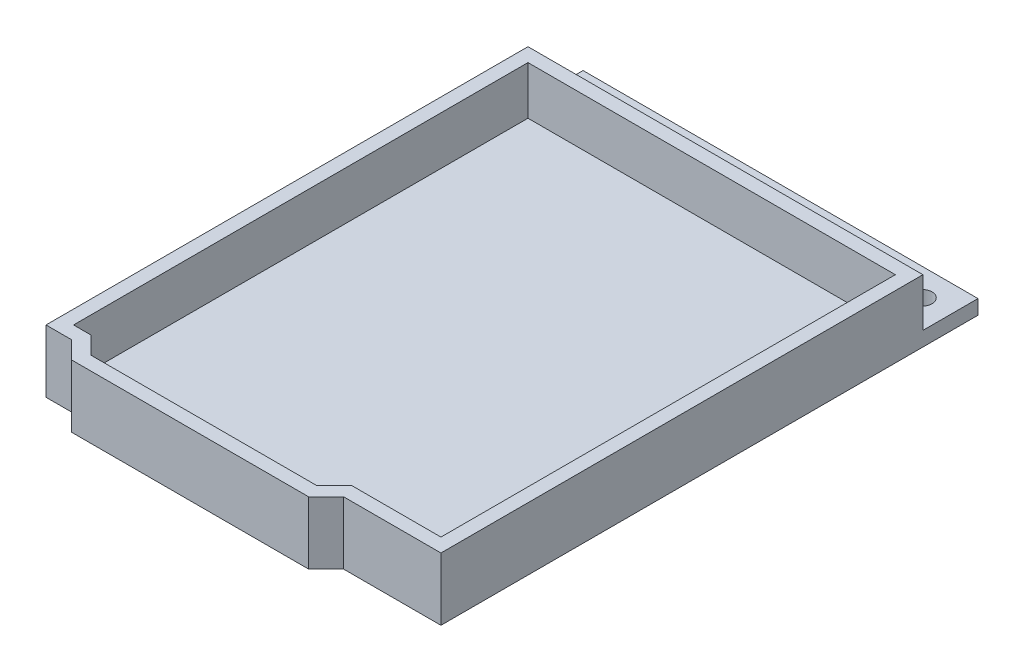
ISO-10303-21;
HEADER;
FILE_DESCRIPTION(('STEP AP214'),'2;1');
FILE_NAME('part.step','',(''),(''),'','','');
FILE_SCHEMA(('AUTOMOTIVE_DESIGN { 1 0 10303 214 1 1 1 1 }'));
ENDSEC;
DATA;
#1=APPLICATION_CONTEXT('core data for automotive mechanical design processes');
#2=APPLICATION_PROTOCOL_DEFINITION('international standard','automotive_design',2000,#1);
#3=PRODUCT_CONTEXT('',#1,'mechanical');
#4=PRODUCT('Part','Part','',(#3));
#5=PRODUCT_RELATED_PRODUCT_CATEGORY('part','',(#4));
#6=PRODUCT_DEFINITION_FORMATION('','',#4);
#7=PRODUCT_DEFINITION_CONTEXT('part definition',#1,'design');
#8=PRODUCT_DEFINITION('design','',#6,#7);
#9=PRODUCT_DEFINITION_SHAPE('','',#8);
#10=(LENGTH_UNIT() NAMED_UNIT(*) SI_UNIT(.MILLI.,.METRE.));
#11=(NAMED_UNIT(*) PLANE_ANGLE_UNIT() SI_UNIT($,.RADIAN.));
#12=(NAMED_UNIT(*) SI_UNIT($,.STERADIAN.) SOLID_ANGLE_UNIT());
#13=UNCERTAINTY_MEASURE_WITH_UNIT(LENGTH_MEASURE(1.E-05),#10,'distance_accuracy_value','');
#14=(GEOMETRIC_REPRESENTATION_CONTEXT(3) GLOBAL_UNCERTAINTY_ASSIGNED_CONTEXT((#13)) GLOBAL_UNIT_ASSIGNED_CONTEXT((#10,
#11,#12)) REPRESENTATION_CONTEXT('',''));
#15=CARTESIAN_POINT('',(0.,0.,0.));
#16=DIRECTION('',(0.,0.,1.));
#17=DIRECTION('',(1.,0.,0.));
#18=AXIS2_PLACEMENT_3D('',#15,#16,#17);
#19=CARTESIAN_POINT('',(28.68,2.1,78.));
#20=DIRECTION('',(0.,0.,-1.));
#21=DIRECTION('',(-1.,0.,0.));
#22=AXIS2_PLACEMENT_3D('',#19,#20,#21);
#23=PLANE('',#22);
#24=DIRECTION('',(1.,0.,0.));
#25=VECTOR('',#24,1.);
#26=CARTESIAN_POINT('',(28.68,0.,78.));
#27=LINE('',#26,#25);
#28=CARTESIAN_POINT('',(-28.68,0.,78.));
#29=VERTEX_POINT('',#28);
#30=CARTESIAN_POINT('',(-24.9684271247462,0.,78.));
#31=VERTEX_POINT('',#30);
#32=EDGE_CURVE('E299',#29,#31,#27,.T.);
#33=ORIENTED_EDGE('',*,*,#32,.T.);
#34=DIRECTION('',(0.,1.,0.));
#35=VECTOR('',#34,1.);
#36=CARTESIAN_POINT('',(-24.9684271247462,-41.4677023071934,78.));
#37=LINE('',#36,#35);
#38=CARTESIAN_POINT('',(-24.9684271247462,9.1,78.));
#39=VERTEX_POINT('',#38);
#40=EDGE_CURVE('E188',#31,#39,#37,.T.);
#41=ORIENTED_EDGE('',*,*,#40,.T.);
#42=DIRECTION('',(1.,0.,0.));
#43=VECTOR('',#42,1.);
#44=CARTESIAN_POINT('',(-28.68,9.1,78.));
#45=LINE('',#44,#43);
#46=CARTESIAN_POINT('',(-28.68,9.1,78.));
#47=VERTEX_POINT('',#46);
#48=EDGE_CURVE('E274',#47,#39,#45,.T.);
#49=ORIENTED_EDGE('',*,*,#48,.F.);
#50=DIRECTION('',(0.,-1.,0.));
#51=VECTOR('',#50,1.);
#52=CARTESIAN_POINT('',(-28.68,2.1,78.));
#53=LINE('',#52,#51);
#54=EDGE_CURVE('E43',#47,#29,#53,.T.);
#55=ORIENTED_EDGE('',*,*,#54,.T.);
#56=EDGE_LOOP('',(#33,#41,#49,#55));
#57=FACE_BOUND('',#56,.T.);
#58=ADVANCED_FACE('F35',(#57),#23,.F.);
#59=CARTESIAN_POINT('',(0.,2.1,0.));
#60=DIRECTION('',(0.,-1.,0.));
#61=DIRECTION('',(0.,0.,-1.));
#62=AXIS2_PLACEMENT_3D('',#59,#60,#61);
#63=PLANE('',#62);
#64=CARTESIAN_POINT('',(24.5,2.1,4.00000000000001));
#65=DIRECTION('',(0.,1.,0.));
#66=DIRECTION('',(0.,0.,1.));
#67=AXIS2_PLACEMENT_3D('',#64,#65,#66);
#68=CIRCLE('',#67,1.5);
#69=CARTESIAN_POINT('',(24.5,2.1,5.50000000000001));
#70=VERTEX_POINT('',#69);
#71=EDGE_CURVE('E225',#70,#70,#68,.T.);
#72=ORIENTED_EDGE('',*,*,#71,.F.);
#73=EDGE_LOOP('',(#72));
#74=FACE_BOUND('',#73,.T.);
#75=CARTESIAN_POINT('',(-24.5,2.1,4.00000000000001));
#76=DIRECTION('',(0.,1.,0.));
#77=DIRECTION('',(0.,0.,1.));
#78=AXIS2_PLACEMENT_3D('',#75,#76,#77);
#79=CIRCLE('',#78,1.5);
#80=CARTESIAN_POINT('',(-24.5,2.1,5.50000000000001));
#81=VERTEX_POINT('',#80);
#82=EDGE_CURVE('E224',#81,#81,#79,.T.);
#83=ORIENTED_EDGE('',*,*,#82,.F.);
#84=EDGE_LOOP('',(#83));
#85=FACE_BOUND('',#84,.T.);
#86=DIRECTION('',(-1.,0.,0.));
#87=VECTOR('',#86,1.);
#88=CARTESIAN_POINT('',(28.68,2.1,8.));
#89=LINE('',#88,#87);
#90=CARTESIAN_POINT('',(28.68,2.1,8.));
#91=VERTEX_POINT('',#90);
#92=CARTESIAN_POINT('',(-28.68,2.1,8.));
#93=VERTEX_POINT('',#92);
#94=EDGE_CURVE('E260',#91,#93,#89,.T.);
#95=ORIENTED_EDGE('',*,*,#94,.F.);
#96=DIRECTION('',(0.,0.,-1.));
#97=VECTOR('',#96,1.);
#98=CARTESIAN_POINT('',(28.68,2.1,8.));
#99=LINE('',#98,#97);
#100=CARTESIAN_POINT('',(28.68,2.1,0.));
#101=VERTEX_POINT('',#100);
#102=EDGE_CURVE('E291',#91,#101,#99,.T.);
#103=ORIENTED_EDGE('',*,*,#102,.T.);
#104=DIRECTION('',(-1.,0.,0.));
#105=VECTOR('',#104,1.);
#106=CARTESIAN_POINT('',(28.68,2.1,0.));
#107=LINE('',#106,#105);
#108=CARTESIAN_POINT('',(-28.68,2.1,0.));
#109=VERTEX_POINT('',#108);
#110=EDGE_CURVE('E285',#101,#109,#107,.T.);
#111=ORIENTED_EDGE('',*,*,#110,.T.);
#112=DIRECTION('',(0.,0.,1.));
#113=VECTOR('',#112,1.);
#114=CARTESIAN_POINT('',(-28.68,2.1,78.));
#115=LINE('',#114,#113);
#116=EDGE_CURVE('E288',#109,#93,#115,.T.);
#117=ORIENTED_EDGE('',*,*,#116,.T.);
#118=EDGE_LOOP('',(#95,#103,#111,#117));
#119=FACE_BOUND('',#118,.T.);
#120=ADVANCED_FACE('F334',(#74,#85,#119),#63,.F.);
#121=CARTESIAN_POINT('',(28.68,2.1,0.));
#122=DIRECTION('',(0.,0.,1.));
#123=DIRECTION('',(1.,0.,0.));
#124=AXIS2_PLACEMENT_3D('',#121,#122,#123);
#125=PLANE('',#124);
#126=DIRECTION('',(-1.,0.,0.));
#127=VECTOR('',#126,1.);
#128=CARTESIAN_POINT('',(28.68,0.,0.));
#129=LINE('',#128,#127);
#130=CARTESIAN_POINT('',(28.68,0.,0.));
#131=VERTEX_POINT('',#130);
#132=CARTESIAN_POINT('',(-28.68,0.,0.));
#133=VERTEX_POINT('',#132);
#134=EDGE_CURVE('E284',#131,#133,#129,.T.);
#135=ORIENTED_EDGE('',*,*,#134,.T.);
#136=DIRECTION('',(0.,-1.,0.));
#137=VECTOR('',#136,1.);
#138=CARTESIAN_POINT('',(-28.68,2.1,0.));
#139=LINE('',#138,#137);
#140=EDGE_CURVE('E11',#109,#133,#139,.T.);
#141=ORIENTED_EDGE('',*,*,#140,.F.);
#142=ORIENTED_EDGE('',*,*,#110,.F.);
#143=DIRECTION('',(0.,-1.,0.));
#144=VECTOR('',#143,1.);
#145=CARTESIAN_POINT('',(28.68,2.1,0.));
#146=LINE('',#145,#144);
#147=EDGE_CURVE('E293',#101,#131,#146,.T.);
#148=ORIENTED_EDGE('',*,*,#147,.T.);
#149=EDGE_LOOP('',(#135,#141,#142,#148));
#150=FACE_BOUND('',#149,.T.);
#151=ADVANCED_FACE('F37',(#150),#125,.F.);
#152=CARTESIAN_POINT('',(-28.68,2.1,78.));
#153=DIRECTION('',(1.,0.,0.));
#154=DIRECTION('',(0.,0.,-1.));
#155=AXIS2_PLACEMENT_3D('',#152,#153,#154);
#156=PLANE('',#155);
#157=DIRECTION('',(0.,0.,1.));
#158=VECTOR('',#157,1.);
#159=CARTESIAN_POINT('',(-28.68,0.,78.));
#160=LINE('',#159,#158);
#161=EDGE_CURVE('E296',#133,#29,#160,.T.);
#162=ORIENTED_EDGE('',*,*,#161,.T.);
#163=ORIENTED_EDGE('',*,*,#54,.F.);
#164=DIRECTION('',(0.,0.,1.));
#165=VECTOR('',#164,1.);
#166=CARTESIAN_POINT('',(-28.68,9.1,8.));
#167=LINE('',#166,#165);
#168=CARTESIAN_POINT('',(-28.68,9.1,8.));
#169=VERTEX_POINT('',#168);
#170=EDGE_CURVE('E270',#169,#47,#167,.T.);
#171=ORIENTED_EDGE('',*,*,#170,.F.);
#172=DIRECTION('',(0.,-1.,0.));
#173=VECTOR('',#172,1.);
#174=CARTESIAN_POINT('',(-28.68,9.1,8.));
#175=LINE('',#174,#173);
#176=EDGE_CURVE('E276',#169,#93,#175,.T.);
#177=ORIENTED_EDGE('',*,*,#176,.T.);
#178=ORIENTED_EDGE('',*,*,#116,.F.);
#179=ORIENTED_EDGE('',*,*,#140,.T.);
#180=EDGE_LOOP('',(#162,#163,#171,#177,#178,#179));
#181=FACE_BOUND('',#180,.T.);
#182=ADVANCED_FACE('F328',(#181),#156,.F.);
#183=CARTESIAN_POINT('',(14.5384271247462,9.1,78.));
#184=VERTEX_POINT('',#183);
#185=CARTESIAN_POINT('',(28.68,9.1,78.));
#186=VERTEX_POINT('',#185);
#187=EDGE_CURVE('E273',#184,#186,#45,.T.);
#188=ORIENTED_EDGE('',*,*,#187,.F.);
#189=DIRECTION('',(0.,1.,0.));
#190=VECTOR('',#189,1.);
#191=CARTESIAN_POINT('',(14.5384271247462,-41.4677023071934,78.));
#192=LINE('',#191,#190);
#193=CARTESIAN_POINT('',(14.5384271247462,0.,78.));
#194=VERTEX_POINT('',#193);
#195=EDGE_CURVE('E205',#194,#184,#192,.T.);
#196=ORIENTED_EDGE('',*,*,#195,.F.);
#197=CARTESIAN_POINT('',(28.68,0.,78.));
#198=VERTEX_POINT('',#197);
#199=EDGE_CURVE('E298',#194,#198,#27,.T.);
#200=ORIENTED_EDGE('',*,*,#199,.T.);
#201=DIRECTION('',(0.,-1.,0.));
#202=VECTOR('',#201,1.);
#203=CARTESIAN_POINT('',(28.68,2.1,78.));
#204=LINE('',#203,#202);
#205=EDGE_CURVE('E304',#186,#198,#204,.T.);
#206=ORIENTED_EDGE('',*,*,#205,.F.);
#207=EDGE_LOOP('',(#188,#196,#200,#206));
#208=FACE_BOUND('',#207,.T.);
#209=ADVANCED_FACE('F346',(#208),#23,.F.);
#210=CARTESIAN_POINT('',(28.68,2.1,0.));
#211=DIRECTION('',(-1.,0.,0.));
#212=DIRECTION('',(0.,0.,1.));
#213=AXIS2_PLACEMENT_3D('',#210,#211,#212);
#214=PLANE('',#213);
#215=DIRECTION('',(0.,0.,-1.));
#216=VECTOR('',#215,1.);
#217=CARTESIAN_POINT('',(28.68,0.,0.));
#218=LINE('',#217,#216);
#219=EDGE_CURVE('E289',#198,#131,#218,.T.);
#220=ORIENTED_EDGE('',*,*,#219,.T.);
#221=ORIENTED_EDGE('',*,*,#147,.F.);
#222=ORIENTED_EDGE('',*,*,#102,.F.);
#223=DIRECTION('',(0.,-1.,0.));
#224=VECTOR('',#223,1.);
#225=CARTESIAN_POINT('',(28.68,9.1,8.));
#226=LINE('',#225,#224);
#227=CARTESIAN_POINT('',(28.68,9.1,8.));
#228=VERTEX_POINT('',#227);
#229=EDGE_CURVE('E281',#228,#91,#226,.T.);
#230=ORIENTED_EDGE('',*,*,#229,.F.);
#231=DIRECTION('',(0.,0.,-1.));
#232=VECTOR('',#231,1.);
#233=CARTESIAN_POINT('',(28.68,9.1,78.));
#234=LINE('',#233,#232);
#235=EDGE_CURVE('E265',#186,#228,#234,.T.);
#236=ORIENTED_EDGE('',*,*,#235,.F.);
#237=ORIENTED_EDGE('',*,*,#205,.T.);
#238=EDGE_LOOP('',(#220,#221,#222,#230,#236,#237));
#239=FACE_BOUND('',#238,.T.);
#240=ADVANCED_FACE('F337',(#239),#214,.F.);
#241=CARTESIAN_POINT('',(0.,0.,0.));
#242=DIRECTION('',(0.,-1.,0.));
#243=DIRECTION('',(0.,0.,-1.));
#244=AXIS2_PLACEMENT_3D('',#241,#242,#243);
#245=PLANE('',#244);
#246=ORIENTED_EDGE('',*,*,#199,.F.);
#247=DIRECTION('',(0.707106781186541,0.,-0.707106781186554));
#248=VECTOR('',#247,1.);
#249=CARTESIAN_POINT('',(14.5384271247462,0.,78.));
#250=LINE('',#249,#248);
#251=CARTESIAN_POINT('',(11.9984271247463,0.,80.54));
#252=VERTEX_POINT('',#251);
#253=EDGE_CURVE('E203',#252,#194,#250,.T.);
#254=ORIENTED_EDGE('',*,*,#253,.F.);
#255=DIRECTION('',(1.,0.,0.));
#256=VECTOR('',#255,1.);
#257=CARTESIAN_POINT('',(-22.4284271247462,0.,80.54));
#258=LINE('',#257,#256);
#259=CARTESIAN_POINT('',(-22.4284271247462,0.,80.54));
#260=VERTEX_POINT('',#259);
#261=EDGE_CURVE('E207',#260,#252,#258,.T.);
#262=ORIENTED_EDGE('',*,*,#261,.F.);
#263=DIRECTION('',(0.707106781186548,0.,0.707106781186548));
#264=VECTOR('',#263,1.);
#265=CARTESIAN_POINT('',(-24.9684271247462,0.,78.));
#266=LINE('',#265,#264);
#267=EDGE_CURVE('E211',#31,#260,#266,.T.);
#268=ORIENTED_EDGE('',*,*,#267,.F.);
#269=ORIENTED_EDGE('',*,*,#32,.F.);
#270=ORIENTED_EDGE('',*,*,#161,.F.);
#271=ORIENTED_EDGE('',*,*,#134,.F.);
#272=ORIENTED_EDGE('',*,*,#219,.F.);
#273=EDGE_LOOP('',(#246,#254,#262,#268,#269,#270,#271,#272));
#274=FACE_BOUND('',#273,.T.);
#275=CARTESIAN_POINT('',(24.5,0.,4.00000000000001));
#276=DIRECTION('',(0.,-1.,0.));
#277=DIRECTION('',(0.,0.,-1.));
#278=AXIS2_PLACEMENT_3D('',#275,#276,#277);
#279=CIRCLE('',#278,1.5);
#280=CARTESIAN_POINT('',(24.5,0.,2.5));
#281=VERTEX_POINT('',#280);
#282=EDGE_CURVE('E228',#281,#281,#279,.F.);
#283=ORIENTED_EDGE('',*,*,#282,.T.);
#284=EDGE_LOOP('',(#283));
#285=FACE_BOUND('',#284,.T.);
#286=CARTESIAN_POINT('',(-24.5,0.,4.00000000000001));
#287=DIRECTION('',(0.,-1.,0.));
#288=DIRECTION('',(0.,0.,-1.));
#289=AXIS2_PLACEMENT_3D('',#286,#287,#288);
#290=CIRCLE('',#289,1.5);
#291=CARTESIAN_POINT('',(-24.5,0.,2.50000000000001));
#292=VERTEX_POINT('',#291);
#293=EDGE_CURVE('E229',#292,#292,#290,.F.);
#294=ORIENTED_EDGE('',*,*,#293,.T.);
#295=EDGE_LOOP('',(#294));
#296=FACE_BOUND('',#295,.T.);
#297=ADVANCED_FACE('F315',(#274,#285,#296),#245,.T.);
#298=CARTESIAN_POINT('',(28.68,9.1,8.));
#299=DIRECTION('',(0.,0.,1.));
#300=DIRECTION('',(1.,0.,0.));
#301=AXIS2_PLACEMENT_3D('',#298,#299,#300);
#302=PLANE('',#301);
#303=ORIENTED_EDGE('',*,*,#94,.T.);
#304=ORIENTED_EDGE('',*,*,#176,.F.);
#305=DIRECTION('',(-1.,0.,0.));
#306=VECTOR('',#305,1.);
#307=CARTESIAN_POINT('',(28.68,9.1,8.));
#308=LINE('',#307,#306);
#309=EDGE_CURVE('E268',#228,#169,#308,.T.);
#310=ORIENTED_EDGE('',*,*,#309,.F.);
#311=ORIENTED_EDGE('',*,*,#229,.T.);
#312=EDGE_LOOP('',(#303,#304,#310,#311));
#313=FACE_BOUND('',#312,.T.);
#314=ADVANCED_FACE('F330',(#313),#302,.F.);
#315=CARTESIAN_POINT('',(0.,9.1,0.));
#316=DIRECTION('',(0.,1.,0.));
#317=DIRECTION('',(0.,0.,1.));
#318=AXIS2_PLACEMENT_3D('',#315,#316,#317);
#319=PLANE('',#318);
#320=DIRECTION('',(0.707106781186541,0.,-0.707106781186554));
#321=VECTOR('',#320,1.);
#322=CARTESIAN_POINT('',(14.5384271247462,9.1,78.));
#323=LINE('',#322,#321);
#324=CARTESIAN_POINT('',(11.9984271247463,9.1,80.54));
#325=VERTEX_POINT('',#324);
#326=EDGE_CURVE('E195',#325,#184,#323,.T.);
#327=ORIENTED_EDGE('',*,*,#326,.T.);
#328=ORIENTED_EDGE('',*,*,#187,.T.);
#329=ORIENTED_EDGE('',*,*,#235,.T.);
#330=ORIENTED_EDGE('',*,*,#309,.T.);
#331=ORIENTED_EDGE('',*,*,#170,.T.);
#332=ORIENTED_EDGE('',*,*,#48,.T.);
#333=DIRECTION('',(0.707106781186548,0.,0.707106781186548));
#334=VECTOR('',#333,1.);
#335=CARTESIAN_POINT('',(-24.9684271247462,9.1,78.));
#336=LINE('',#335,#334);
#337=CARTESIAN_POINT('',(-22.4284271247462,9.1,80.54));
#338=VERTEX_POINT('',#337);
#339=EDGE_CURVE('E182',#39,#338,#336,.T.);
#340=ORIENTED_EDGE('',*,*,#339,.T.);
#341=DIRECTION('',(1.,0.,0.));
#342=VECTOR('',#341,1.);
#343=CARTESIAN_POINT('',(-22.4284271247462,9.1,80.54));
#344=LINE('',#343,#342);
#345=EDGE_CURVE('E198',#338,#325,#344,.T.);
#346=ORIENTED_EDGE('',*,*,#345,.T.);
#347=EDGE_LOOP('',(#327,#328,#329,#330,#331,#332,#340,#346));
#348=FACE_BOUND('',#347,.T.);
#349=DIRECTION('',(0.,0.,-1.));
#350=VECTOR('',#349,1.);
#351=CARTESIAN_POINT('',(26.68,9.1,10.));
#352=LINE('',#351,#350);
#353=CARTESIAN_POINT('',(26.68,9.1,76.));
#354=VERTEX_POINT('',#353);
#355=CARTESIAN_POINT('',(26.68,9.1,10.));
#356=VERTEX_POINT('',#355);
#357=EDGE_CURVE('E253',#354,#356,#352,.T.);
#358=ORIENTED_EDGE('',*,*,#357,.F.);
#359=DIRECTION('',(1.,0.,0.));
#360=VECTOR('',#359,1.);
#361=CARTESIAN_POINT('',(-26.68,9.1,76.));
#362=LINE('',#361,#360);
#363=CARTESIAN_POINT('',(13.71,9.1,76.));
#364=VERTEX_POINT('',#363);
#365=EDGE_CURVE('E251',#364,#354,#362,.T.);
#366=ORIENTED_EDGE('',*,*,#365,.F.);
#367=DIRECTION('',(-0.707106781186548,0.,0.707106781186548));
#368=VECTOR('',#367,1.);
#369=CARTESIAN_POINT('',(13.71,9.1,76.));
#370=LINE('',#369,#368);
#371=CARTESIAN_POINT('',(11.17,9.1,78.54));
#372=VERTEX_POINT('',#371);
#373=EDGE_CURVE('E192',#364,#372,#370,.T.);
#374=ORIENTED_EDGE('',*,*,#373,.T.);
#375=DIRECTION('',(-1.,0.,0.));
#376=VECTOR('',#375,1.);
#377=CARTESIAN_POINT('',(-21.6,9.1,78.54));
#378=LINE('',#377,#376);
#379=CARTESIAN_POINT('',(-21.6,9.1,78.54));
#380=VERTEX_POINT('',#379);
#381=EDGE_CURVE('E190',#372,#380,#378,.T.);
#382=ORIENTED_EDGE('',*,*,#381,.T.);
#383=DIRECTION('',(-0.707106781186548,0.,-0.707106781186548));
#384=VECTOR('',#383,1.);
#385=CARTESIAN_POINT('',(-21.6,9.1,78.54));
#386=LINE('',#385,#384);
#387=CARTESIAN_POINT('',(-24.14,9.1,76.));
#388=VERTEX_POINT('',#387);
#389=EDGE_CURVE('E165',#380,#388,#386,.T.);
#390=ORIENTED_EDGE('',*,*,#389,.T.);
#391=DIRECTION('',(-1.,0.,0.));
#392=VECTOR('',#391,1.);
#393=CARTESIAN_POINT('',(-26.68,9.1,76.));
#394=LINE('',#393,#392);
#395=CARTESIAN_POINT('',(-26.68,9.1,76.));
#396=VERTEX_POINT('',#395);
#397=EDGE_CURVE('E185',#388,#396,#394,.T.);
#398=ORIENTED_EDGE('',*,*,#397,.T.);
#399=DIRECTION('',(0.,0.,1.));
#400=VECTOR('',#399,1.);
#401=CARTESIAN_POINT('',(-26.68,9.1,10.));
#402=LINE('',#401,#400);
#403=CARTESIAN_POINT('',(-26.68,9.1,10.));
#404=VERTEX_POINT('',#403);
#405=EDGE_CURVE('E232',#404,#396,#402,.T.);
#406=ORIENTED_EDGE('',*,*,#405,.F.);
#407=DIRECTION('',(-1.,0.,0.));
#408=VECTOR('',#407,1.);
#409=CARTESIAN_POINT('',(-26.68,9.1,10.));
#410=LINE('',#409,#408);
#411=EDGE_CURVE('E240',#356,#404,#410,.T.);
#412=ORIENTED_EDGE('',*,*,#411,.F.);
#413=EDGE_LOOP('',(#358,#366,#374,#382,#390,#398,#406,#412));
#414=FACE_BOUND('',#413,.T.);
#415=ADVANCED_FACE('F325',(#348,#414),#319,.T.);
#416=CARTESIAN_POINT('',(-26.68,2.1,10.));
#417=DIRECTION('',(-1.,0.,0.));
#418=DIRECTION('',(0.,0.,1.));
#419=AXIS2_PLACEMENT_3D('',#416,#417,#418);
#420=PLANE('',#419);
#421=ORIENTED_EDGE('',*,*,#405,.T.);
#422=DIRECTION('',(0.,1.,0.));
#423=VECTOR('',#422,1.);
#424=CARTESIAN_POINT('',(-26.68,-41.4677023071934,76.));
#425=LINE('',#424,#423);
#426=CARTESIAN_POINT('',(-26.68,2.09999999999997,76.));
#427=VERTEX_POINT('',#426);
#428=EDGE_CURVE('E214',#427,#396,#425,.T.);
#429=ORIENTED_EDGE('',*,*,#428,.F.);
#430=DIRECTION('',(0.,0.,1.));
#431=VECTOR('',#430,1.);
#432=CARTESIAN_POINT('',(-26.68,2.1,10.));
#433=LINE('',#432,#431);
#434=CARTESIAN_POINT('',(-26.68,2.1,10.));
#435=VERTEX_POINT('',#434);
#436=EDGE_CURVE('E237',#435,#427,#433,.T.);
#437=ORIENTED_EDGE('',*,*,#436,.F.);
#438=DIRECTION('',(0.,1.,0.));
#439=VECTOR('',#438,1.);
#440=CARTESIAN_POINT('',(-26.68,2.1,10.));
#441=LINE('',#440,#439);
#442=EDGE_CURVE('E258',#435,#404,#441,.T.);
#443=ORIENTED_EDGE('',*,*,#442,.T.);
#444=EDGE_LOOP('',(#421,#429,#437,#443));
#445=FACE_BOUND('',#444,.T.);
#446=ADVANCED_FACE('F438',(#445),#420,.F.);
#447=CARTESIAN_POINT('',(-26.68,2.1,10.));
#448=DIRECTION('',(0.,0.,-1.));
#449=DIRECTION('',(-1.,0.,0.));
#450=AXIS2_PLACEMENT_3D('',#447,#448,#449);
#451=PLANE('',#450);
#452=ORIENTED_EDGE('',*,*,#411,.T.);
#453=ORIENTED_EDGE('',*,*,#442,.F.);
#454=DIRECTION('',(-1.,0.,0.));
#455=VECTOR('',#454,1.);
#456=CARTESIAN_POINT('',(-26.68,2.1,10.));
#457=LINE('',#456,#455);
#458=CARTESIAN_POINT('',(26.68,2.1,10.));
#459=VERTEX_POINT('',#458);
#460=EDGE_CURVE('E245',#459,#435,#457,.T.);
#461=ORIENTED_EDGE('',*,*,#460,.F.);
#462=DIRECTION('',(0.,1.,0.));
#463=VECTOR('',#462,1.);
#464=CARTESIAN_POINT('',(26.68,2.1,10.));
#465=LINE('',#464,#463);
#466=EDGE_CURVE('E261',#459,#356,#465,.T.);
#467=ORIENTED_EDGE('',*,*,#466,.T.);
#468=EDGE_LOOP('',(#452,#453,#461,#467));
#469=FACE_BOUND('',#468,.T.);
#470=ADVANCED_FACE('F449',(#469),#451,.F.);
#471=CARTESIAN_POINT('',(26.68,2.1,10.));
#472=DIRECTION('',(1.,0.,0.));
#473=DIRECTION('',(0.,0.,-1.));
#474=AXIS2_PLACEMENT_3D('',#471,#472,#473);
#475=PLANE('',#474);
#476=ORIENTED_EDGE('',*,*,#357,.T.);
#477=ORIENTED_EDGE('',*,*,#466,.F.);
#478=DIRECTION('',(0.,0.,-1.));
#479=VECTOR('',#478,1.);
#480=CARTESIAN_POINT('',(26.68,2.1,10.));
#481=LINE('',#480,#479);
#482=CARTESIAN_POINT('',(26.68,2.1,76.));
#483=VERTEX_POINT('',#482);
#484=EDGE_CURVE('E242',#483,#459,#481,.T.);
#485=ORIENTED_EDGE('',*,*,#484,.F.);
#486=DIRECTION('',(0.,1.,0.));
#487=VECTOR('',#486,1.);
#488=CARTESIAN_POINT('',(26.68,2.1,76.));
#489=LINE('',#488,#487);
#490=EDGE_CURVE('E248',#483,#354,#489,.T.);
#491=ORIENTED_EDGE('',*,*,#490,.T.);
#492=EDGE_LOOP('',(#476,#477,#485,#491));
#493=FACE_BOUND('',#492,.T.);
#494=ADVANCED_FACE('F394',(#493),#475,.F.);
#495=CARTESIAN_POINT('',(-26.68,2.1,76.));
#496=DIRECTION('',(0.,0.,1.));
#497=DIRECTION('',(1.,0.,0.));
#498=AXIS2_PLACEMENT_3D('',#495,#496,#497);
#499=PLANE('',#498);
#500=ORIENTED_EDGE('',*,*,#490,.F.);
#501=DIRECTION('',(1.,0.,0.));
#502=VECTOR('',#501,1.);
#503=CARTESIAN_POINT('',(-26.68,2.1,76.));
#504=LINE('',#503,#502);
#505=CARTESIAN_POINT('',(13.71,2.1,76.));
#506=VERTEX_POINT('',#505);
#507=EDGE_CURVE('E239',#506,#483,#504,.T.);
#508=ORIENTED_EDGE('',*,*,#507,.F.);
#509=DIRECTION('',(0.,1.,0.));
#510=VECTOR('',#509,1.);
#511=CARTESIAN_POINT('',(13.71,-40.439486890909,76.));
#512=LINE('',#511,#510);
#513=EDGE_CURVE('E55',#506,#364,#512,.T.);
#514=ORIENTED_EDGE('',*,*,#513,.T.);
#515=ORIENTED_EDGE('',*,*,#365,.T.);
#516=EDGE_LOOP('',(#500,#508,#514,#515));
#517=FACE_BOUND('',#516,.T.);
#518=ADVANCED_FACE('F484',(#517),#499,.F.);
#519=CARTESIAN_POINT('',(0.,2.1,0.));
#520=DIRECTION('',(0.,1.,0.));
#521=DIRECTION('',(0.,0.,1.));
#522=AXIS2_PLACEMENT_3D('',#519,#520,#521);
#523=PLANE('',#522);
#524=ORIENTED_EDGE('',*,*,#436,.T.);
#525=CARTESIAN_POINT('',(-24.14,2.09999999999997,76.));
#526=VERTEX_POINT('',#525);
#527=EDGE_CURVE('E180',#427,#526,#504,.T.);
#528=ORIENTED_EDGE('',*,*,#527,.T.);
#529=DIRECTION('',(-0.707106781186548,0.,-0.707106781186548));
#530=VECTOR('',#529,1.);
#531=CARTESIAN_POINT('',(-24.14,2.1,76.));
#532=LINE('',#531,#530);
#533=CARTESIAN_POINT('',(-21.6,2.10000000000001,78.54));
#534=VERTEX_POINT('',#533);
#535=EDGE_CURVE('E162',#534,#526,#532,.T.);
#536=ORIENTED_EDGE('',*,*,#535,.F.);
#537=DIRECTION('',(-1.,0.,0.));
#538=VECTOR('',#537,1.);
#539=CARTESIAN_POINT('',(-21.6,2.1,78.54));
#540=LINE('',#539,#538);
#541=CARTESIAN_POINT('',(11.17,2.1,78.54));
#542=VERTEX_POINT('',#541);
#543=EDGE_CURVE('E173',#542,#534,#540,.T.);
#544=ORIENTED_EDGE('',*,*,#543,.F.);
#545=DIRECTION('',(-0.707106781186548,0.,0.707106781186548));
#546=VECTOR('',#545,1.);
#547=CARTESIAN_POINT('',(11.17,2.1,78.54));
#548=LINE('',#547,#546);
#549=EDGE_CURVE('E50',#506,#542,#548,.T.);
#550=ORIENTED_EDGE('',*,*,#549,.F.);
#551=ORIENTED_EDGE('',*,*,#507,.T.);
#552=ORIENTED_EDGE('',*,*,#484,.T.);
#553=ORIENTED_EDGE('',*,*,#460,.T.);
#554=EDGE_LOOP('',(#524,#528,#536,#544,#550,#551,#552,#553));
#555=FACE_BOUND('',#554,.T.);
#556=ADVANCED_FACE('F179',(#555),#523,.T.);
#557=CARTESIAN_POINT('',(-24.5,-4.24264068711929,4.00000000000001));
#558=DIRECTION('',(0.,1.,0.));
#559=DIRECTION('',(0.,0.,1.));
#560=AXIS2_PLACEMENT_3D('',#557,#558,#559);
#561=CYLINDRICAL_SURFACE('',#560,1.5);
#562=ORIENTED_EDGE('',*,*,#82,.T.);
#563=EDGE_LOOP('',(#562));
#564=FACE_BOUND('',#563,.T.);
#565=ORIENTED_EDGE('',*,*,#293,.F.);
#566=EDGE_LOOP('',(#565));
#567=FACE_BOUND('',#566,.T.);
#568=ADVANCED_FACE('F399',(#564,#567),#561,.F.);
#569=CARTESIAN_POINT('',(24.5,-4.24264068711929,4.00000000000001));
#570=DIRECTION('',(0.,1.,0.));
#571=DIRECTION('',(0.,0.,1.));
#572=AXIS2_PLACEMENT_3D('',#569,#570,#571);
#573=CYLINDRICAL_SURFACE('',#572,1.5);
#574=ORIENTED_EDGE('',*,*,#71,.T.);
#575=EDGE_LOOP('',(#574));
#576=FACE_BOUND('',#575,.T.);
#577=ORIENTED_EDGE('',*,*,#282,.F.);
#578=EDGE_LOOP('',(#577));
#579=FACE_BOUND('',#578,.T.);
#580=ADVANCED_FACE('F362',(#576,#579),#573,.F.);
#581=CARTESIAN_POINT('',(-24.9684271247462,-41.4677023071934,78.));
#582=DIRECTION('',(-0.707106781186547,0.,0.707106781186547));
#583=DIRECTION('',(0.707106781186548,0.,0.707106781186548));
#584=AXIS2_PLACEMENT_3D('',#581,#582,#583);
#585=PLANE('',#584);
#586=ORIENTED_EDGE('',*,*,#40,.F.);
#587=ORIENTED_EDGE('',*,*,#267,.T.);
#588=DIRECTION('',(0.,1.,0.));
#589=VECTOR('',#588,1.);
#590=CARTESIAN_POINT('',(-22.4284271247462,-41.4677023071934,80.54));
#591=LINE('',#590,#589);
#592=EDGE_CURVE('E210',#260,#338,#591,.T.);
#593=ORIENTED_EDGE('',*,*,#592,.T.);
#594=ORIENTED_EDGE('',*,*,#339,.F.);
#595=EDGE_LOOP('',(#586,#587,#593,#594));
#596=FACE_BOUND('',#595,.T.);
#597=ADVANCED_FACE('F322',(#596),#585,.T.);
#598=CARTESIAN_POINT('',(-22.4284271247462,-41.4677023071934,80.54));
#599=DIRECTION('',(0.,0.,1.));
#600=DIRECTION('',(1.,0.,0.));
#601=AXIS2_PLACEMENT_3D('',#598,#599,#600);
#602=PLANE('',#601);
#603=ORIENTED_EDGE('',*,*,#592,.F.);
#604=ORIENTED_EDGE('',*,*,#261,.T.);
#605=DIRECTION('',(0.,1.,0.));
#606=VECTOR('',#605,1.);
#607=CARTESIAN_POINT('',(11.9984271247463,-41.4677023071934,80.54));
#608=LINE('',#607,#606);
#609=EDGE_CURVE('E206',#252,#325,#608,.T.);
#610=ORIENTED_EDGE('',*,*,#609,.T.);
#611=ORIENTED_EDGE('',*,*,#345,.F.);
#612=EDGE_LOOP('',(#603,#604,#610,#611));
#613=FACE_BOUND('',#612,.T.);
#614=ADVANCED_FACE('F353',(#613),#602,.T.);
#615=CARTESIAN_POINT('',(14.5384271247462,-41.4677023071934,78.));
#616=DIRECTION('',(0.707106781186554,0.,0.707106781186541));
#617=DIRECTION('',(0.707106781186541,0.,-0.707106781186554));
#618=AXIS2_PLACEMENT_3D('',#615,#616,#617);
#619=PLANE('',#618);
#620=ORIENTED_EDGE('',*,*,#609,.F.);
#621=ORIENTED_EDGE('',*,*,#253,.T.);
#622=ORIENTED_EDGE('',*,*,#195,.T.);
#623=ORIENTED_EDGE('',*,*,#326,.F.);
#624=EDGE_LOOP('',(#620,#621,#622,#623));
#625=FACE_BOUND('',#624,.T.);
#626=ADVANCED_FACE('F351',(#625),#619,.T.);
#627=CARTESIAN_POINT('',(13.71,-41.4677023071934,76.));
#628=DIRECTION('',(-0.707106781186547,0.,-0.707106781186547));
#629=DIRECTION('',(-0.707106781186548,0.,0.707106781186548));
#630=AXIS2_PLACEMENT_3D('',#627,#628,#629);
#631=PLANE('',#630);
#632=ORIENTED_EDGE('',*,*,#549,.T.);
#633=DIRECTION('',(0.,1.,0.));
#634=VECTOR('',#633,1.);
#635=CARTESIAN_POINT('',(11.17,-41.4677023071934,78.54));
#636=LINE('',#635,#634);
#637=EDGE_CURVE('E170',#542,#372,#636,.T.);
#638=ORIENTED_EDGE('',*,*,#637,.T.);
#639=ORIENTED_EDGE('',*,*,#373,.F.);
#640=ORIENTED_EDGE('',*,*,#513,.F.);
#641=EDGE_LOOP('',(#632,#638,#639,#640));
#642=FACE_BOUND('',#641,.T.);
#643=ADVANCED_FACE('F360',(#642),#631,.T.);
#644=CARTESIAN_POINT('',(-21.6,-41.4677023071934,78.54));
#645=DIRECTION('',(0.,0.,-1.));
#646=DIRECTION('',(-1.,0.,0.));
#647=AXIS2_PLACEMENT_3D('',#644,#645,#646);
#648=PLANE('',#647);
#649=ORIENTED_EDGE('',*,*,#543,.T.);
#650=DIRECTION('',(0.,1.,0.));
#651=VECTOR('',#650,1.);
#652=CARTESIAN_POINT('',(-21.6,-41.4677023071934,78.54));
#653=LINE('',#652,#651);
#654=EDGE_CURVE('E158',#534,#380,#653,.T.);
#655=ORIENTED_EDGE('',*,*,#654,.T.);
#656=ORIENTED_EDGE('',*,*,#381,.F.);
#657=ORIENTED_EDGE('',*,*,#637,.F.);
#658=EDGE_LOOP('',(#649,#655,#656,#657));
#659=FACE_BOUND('',#658,.T.);
#660=ADVANCED_FACE('F174',(#659),#648,.T.);
#661=CARTESIAN_POINT('',(-21.6,-41.4677023071934,78.54));
#662=DIRECTION('',(0.707106781186547,0.,-0.707106781186547));
#663=DIRECTION('',(-0.707106781186548,0.,-0.707106781186548));
#664=AXIS2_PLACEMENT_3D('',#661,#662,#663);
#665=PLANE('',#664);
#666=ORIENTED_EDGE('',*,*,#535,.T.);
#667=DIRECTION('',(0.,1.,0.));
#668=VECTOR('',#667,1.);
#669=CARTESIAN_POINT('',(-24.14,-41.4677023071934,76.));
#670=LINE('',#669,#668);
#671=EDGE_CURVE('E169',#526,#388,#670,.T.);
#672=ORIENTED_EDGE('',*,*,#671,.T.);
#673=ORIENTED_EDGE('',*,*,#389,.F.);
#674=ORIENTED_EDGE('',*,*,#654,.F.);
#675=EDGE_LOOP('',(#666,#672,#673,#674));
#676=FACE_BOUND('',#675,.T.);
#677=ADVANCED_FACE('F160',(#676),#665,.T.);
#678=CARTESIAN_POINT('',(-26.68,-41.4677023071934,76.));
#679=DIRECTION('',(0.,0.,-1.));
#680=DIRECTION('',(-1.,0.,0.));
#681=AXIS2_PLACEMENT_3D('',#678,#679,#680);
#682=PLANE('',#681);
#683=ORIENTED_EDGE('',*,*,#671,.F.);
#684=ORIENTED_EDGE('',*,*,#527,.F.);
#685=ORIENTED_EDGE('',*,*,#428,.T.);
#686=ORIENTED_EDGE('',*,*,#397,.F.);
#687=EDGE_LOOP('',(#683,#684,#685,#686));
#688=FACE_BOUND('',#687,.T.);
#689=ADVANCED_FACE('F518',(#688),#682,.T.);
#690=CLOSED_SHELL('',(#58,#120,#151,#182,#209,#240,#297,#314,#415,#446,#470,#494,#518,#556,#568,
#580,#597,#614,#626,#643,#660,#677,#689));
#691=MANIFOLD_SOLID_BREP('B2',#690);
#692=ADVANCED_BREP_SHAPE_REPRESENTATION('',(#18,#691),#14);
#693=SHAPE_DEFINITION_REPRESENTATION(#9,#692);
ENDSEC;
END-ISO-10303-21;
